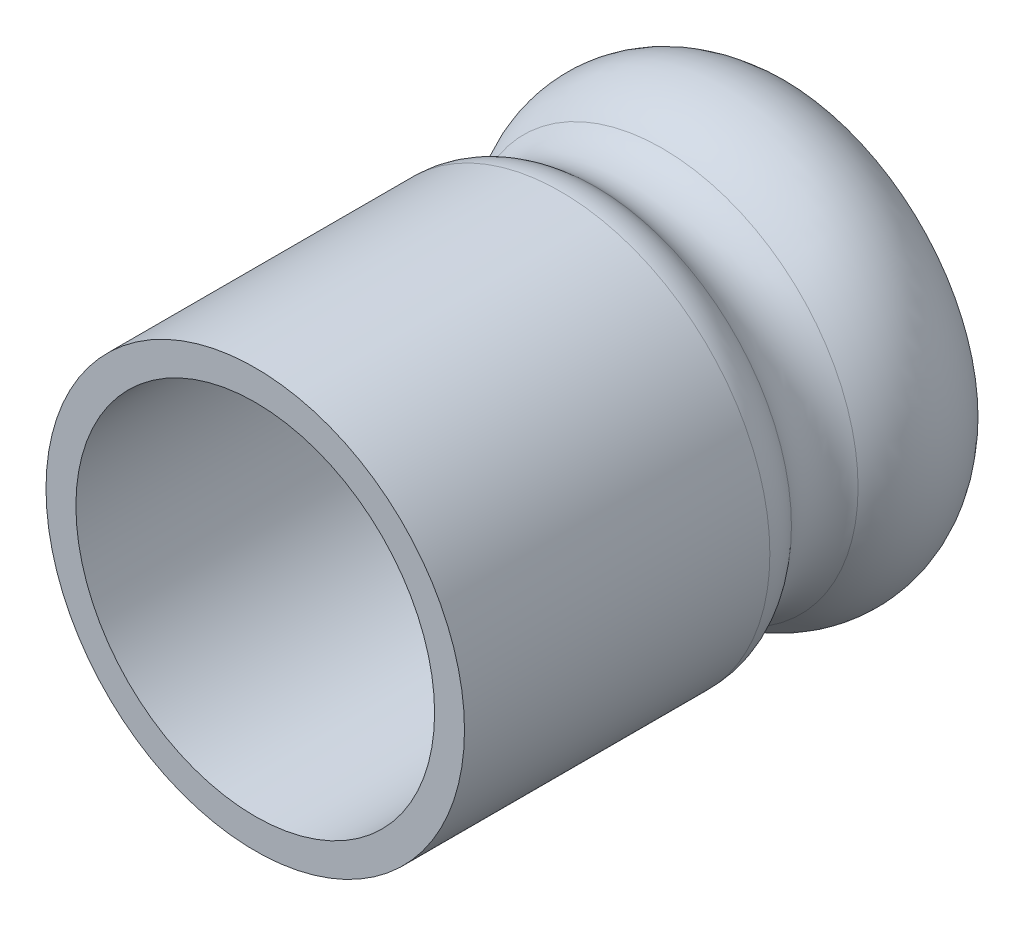
ISO-10303-21;
HEADER;
FILE_DESCRIPTION(('STEP AP214'),'2;1');
FILE_NAME('part.step','',(''),(''),'','','');
FILE_SCHEMA(('AUTOMOTIVE_DESIGN { 1 0 10303 214 1 1 1 1 }'));
ENDSEC;
DATA;
#1=APPLICATION_CONTEXT('core data for automotive mechanical design processes');
#2=APPLICATION_PROTOCOL_DEFINITION('international standard','automotive_design',2000,#1);
#3=PRODUCT_CONTEXT('',#1,'mechanical');
#4=PRODUCT('Part','Part','',(#3));
#5=PRODUCT_RELATED_PRODUCT_CATEGORY('part','',(#4));
#6=PRODUCT_DEFINITION_FORMATION('','',#4);
#7=PRODUCT_DEFINITION_CONTEXT('part definition',#1,'design');
#8=PRODUCT_DEFINITION('design','',#6,#7);
#9=PRODUCT_DEFINITION_SHAPE('','',#8);
#10=(LENGTH_UNIT() NAMED_UNIT(*) SI_UNIT(.MILLI.,.METRE.));
#11=(NAMED_UNIT(*) PLANE_ANGLE_UNIT() SI_UNIT($,.RADIAN.));
#12=(NAMED_UNIT(*) SI_UNIT($,.STERADIAN.) SOLID_ANGLE_UNIT());
#13=UNCERTAINTY_MEASURE_WITH_UNIT(LENGTH_MEASURE(1.E-05),#10,'distance_accuracy_value','');
#14=(GEOMETRIC_REPRESENTATION_CONTEXT(3) GLOBAL_UNCERTAINTY_ASSIGNED_CONTEXT((#13)) GLOBAL_UNIT_ASSIGNED_CONTEXT((#10,
#11,#12)) REPRESENTATION_CONTEXT('',''));
#15=CARTESIAN_POINT('',(0.,0.,0.));
#16=DIRECTION('',(0.,0.,1.));
#17=DIRECTION('',(1.,0.,0.));
#18=AXIS2_PLACEMENT_3D('',#15,#16,#17);
#19=CARTESIAN_POINT('',(0.,0.,-25.));
#20=DIRECTION('',(0.,0.,1.));
#21=DIRECTION('',(1.,0.,0.));
#22=AXIS2_PLACEMENT_3D('',#19,#20,#21);
#23=TOROIDAL_SURFACE('',#22,15.5868154157748,3.33681541577476);
#24=CARTESIAN_POINT('',(0.,0.,-27.2294699010187));
#25=DIRECTION('',(0.,0.,1.));
#26=DIRECTION('',(1.,0.,0.));
#27=AXIS2_PLACEMENT_3D('',#24,#25,#26);
#28=CIRCLE('',#27,13.1041150554003);
#29=CARTESIAN_POINT('',(13.1041150554003,0.,-27.2294699010187));
#30=VERTEX_POINT('',#29);
#31=EDGE_CURVE('E10',#30,#30,#28,.T.);
#32=ORIENTED_EDGE('',*,*,#31,.T.);
#33=EDGE_LOOP('',(#32));
#34=FACE_BOUND('',#33,.T.);
#35=CARTESIAN_POINT('',(0.,0.,-22.7705300989813));
#36=DIRECTION('',(0.,0.,1.));
#37=DIRECTION('',(1.,0.,0.));
#38=AXIS2_PLACEMENT_3D('',#35,#36,#37);
#39=CIRCLE('',#38,13.1041150554003);
#40=CARTESIAN_POINT('',(13.1041150554003,0.,-22.7705300989813));
#41=VERTEX_POINT('',#40);
#42=EDGE_CURVE('E67',#41,#41,#39,.T.);
#43=ORIENTED_EDGE('',*,*,#42,.F.);
#44=EDGE_LOOP('',(#43));
#45=FACE_BOUND('',#44,.T.);
#46=ADVANCED_FACE('F33',(#34,#45),#23,.F.);
#47=CARTESIAN_POINT('',(0.,0.,-31.2383279705642));
#48=DIRECTION('',(0.,0.,1.));
#49=DIRECTION('',(1.,0.,0.));
#50=AXIS2_PLACEMENT_3D('',#47,#48,#49);
#51=TOROIDAL_SURFACE('',#50,8.63991781757124,6.);
#52=CARTESIAN_POINT('',(0.,0.,-35.3193337313023));
#53=DIRECTION('',(0.,0.,1.));
#54=DIRECTION('',(1.,0.,0.));
#55=AXIS2_PLACEMENT_3D('',#52,#53,#54);
#56=CIRCLE('',#55,13.0382575021366);
#57=CARTESIAN_POINT('',(13.0382575021366,0.,-35.3193337313023));
#58=VERTEX_POINT('',#57);
#59=EDGE_CURVE('E39',#58,#58,#56,.T.);
#60=ORIENTED_EDGE('',*,*,#59,.T.);
#61=EDGE_LOOP('',(#60));
#62=FACE_BOUND('',#61,.T.);
#63=ORIENTED_EDGE('',*,*,#31,.F.);
#64=EDGE_LOOP('',(#63));
#65=FACE_BOUND('',#64,.T.);
#66=ADVANCED_FACE('F75',(#62,#65),#51,.T.);
#67=CARTESIAN_POINT('',(0.,0.,-35.));
#68=DIRECTION('',(0.,0.,-1.));
#69=DIRECTION('',(-1.,0.,0.));
#70=AXIS2_PLACEMENT_3D('',#67,#68,#69);
#71=CONICAL_SURFACE('',#70,10.,1.46607657167524);
#72=ORIENTED_EDGE('',*,*,#59,.F.);
#73=EDGE_LOOP('',(#72));
#74=FACE_BOUND('',#73,.T.);
#75=CARTESIAN_POINT('',(0.,0.,-35.));
#76=DIRECTION('',(0.,0.,1.));
#77=DIRECTION('',(1.,0.,0.));
#78=AXIS2_PLACEMENT_3D('',#75,#76,#77);
#79=CIRCLE('',#78,10.);
#80=CARTESIAN_POINT('',(10.,0.,-35.));
#81=VERTEX_POINT('',#80);
#82=EDGE_CURVE('E43',#81,#81,#79,.T.);
#83=ORIENTED_EDGE('',*,*,#82,.T.);
#84=EDGE_LOOP('',(#83));
#85=FACE_BOUND('',#84,.T.);
#86=ADVANCED_FACE('F79',(#74,#85),#71,.F.);
#87=CARTESIAN_POINT('',(0.,0.,-31.2383279705642));
#88=DIRECTION('',(0.,0.,1.));
#89=DIRECTION('',(1.,0.,0.));
#90=AXIS2_PLACEMENT_3D('',#87,#88,#89);
#91=TOROIDAL_SURFACE('',#90,8.63991781757124,4.);
#92=ORIENTED_EDGE('',*,*,#82,.F.);
#93=EDGE_LOOP('',(#92));
#94=FACE_BOUND('',#93,.T.);
#95=CARTESIAN_POINT('',(0.,0.,-28.5657559242005));
#96=DIRECTION('',(0.,0.,1.));
#97=DIRECTION('',(1.,0.,0.));
#98=AXIS2_PLACEMENT_3D('',#95,#96,#97);
#99=CIRCLE('',#98,11.6160493094573);
#100=CARTESIAN_POINT('',(11.6160493094573,0.,-28.5657559242005));
#101=VERTEX_POINT('',#100);
#102=EDGE_CURVE('E47',#101,#101,#99,.T.);
#103=ORIENTED_EDGE('',*,*,#102,.T.);
#104=EDGE_LOOP('',(#103));
#105=FACE_BOUND('',#104,.T.);
#106=ADVANCED_FACE('F83',(#94,#105),#91,.F.);
#107=CARTESIAN_POINT('',(0.,0.,-25.));
#108=DIRECTION('',(0.,0.,1.));
#109=DIRECTION('',(1.,0.,0.));
#110=AXIS2_PLACEMENT_3D('',#107,#108,#109);
#111=TOROIDAL_SURFACE('',#110,15.5868154157748,5.33681541577476);
#112=ORIENTED_EDGE('',*,*,#102,.F.);
#113=EDGE_LOOP('',(#112));
#114=FACE_BOUND('',#113,.T.);
#115=CARTESIAN_POINT('',(0.,0.,-21.4342440757995));
#116=DIRECTION('',(0.,0.,1.));
#117=DIRECTION('',(1.,0.,0.));
#118=AXIS2_PLACEMENT_3D('',#115,#116,#117);
#119=CIRCLE('',#118,11.6160493094573);
#120=CARTESIAN_POINT('',(11.6160493094573,0.,-21.4342440757995));
#121=VERTEX_POINT('',#120);
#122=EDGE_CURVE('E52',#121,#121,#119,.T.);
#123=ORIENTED_EDGE('',*,*,#122,.T.);
#124=EDGE_LOOP('',(#123));
#125=FACE_BOUND('',#124,.T.);
#126=ADVANCED_FACE('F90',(#114,#125),#111,.T.);
#127=CARTESIAN_POINT('',(0.,0.,-20.4320295584131));
#128=DIRECTION('',(0.,0.,1.));
#129=DIRECTION('',(1.,0.,0.));
#130=AXIS2_PLACEMENT_3D('',#127,#128,#129);
#131=TOROIDAL_SURFACE('',#130,10.5,1.5);
#132=ORIENTED_EDGE('',*,*,#122,.F.);
#133=EDGE_LOOP('',(#132));
#134=FACE_BOUND('',#133,.T.);
#135=CARTESIAN_POINT('',(0.,0.,-20.4320295584131));
#136=DIRECTION('',(0.,0.,1.));
#137=DIRECTION('',(1.,0.,0.));
#138=AXIS2_PLACEMENT_3D('',#135,#136,#137);
#139=CIRCLE('',#138,12.);
#140=CARTESIAN_POINT('',(12.,0.,-20.4320295584131));
#141=VERTEX_POINT('',#140);
#142=EDGE_CURVE('E55',#141,#141,#139,.T.);
#143=ORIENTED_EDGE('',*,*,#142,.T.);
#144=EDGE_LOOP('',(#143));
#145=FACE_BOUND('',#144,.T.);
#146=ADVANCED_FACE('F94',(#134,#145),#131,.F.);
#147=CARTESIAN_POINT('',(0.,0.,0.));
#148=DIRECTION('',(0.,0.,1.));
#149=DIRECTION('',(1.,0.,0.));
#150=AXIS2_PLACEMENT_3D('',#147,#148,#149);
#151=CYLINDRICAL_SURFACE('',#150,12.);
#152=ORIENTED_EDGE('',*,*,#142,.F.);
#153=EDGE_LOOP('',(#152));
#154=FACE_BOUND('',#153,.T.);
#155=CARTESIAN_POINT('',(0.,0.,0.));
#156=DIRECTION('',(0.,0.,1.));
#157=DIRECTION('',(1.,0.,0.));
#158=AXIS2_PLACEMENT_3D('',#155,#156,#157);
#159=CIRCLE('',#158,12.);
#160=CARTESIAN_POINT('',(12.,0.,0.));
#161=VERTEX_POINT('',#160);
#162=EDGE_CURVE('E58',#161,#161,#159,.T.);
#163=ORIENTED_EDGE('',*,*,#162,.T.);
#164=EDGE_LOOP('',(#163));
#165=FACE_BOUND('',#164,.T.);
#166=ADVANCED_FACE('F98',(#154,#165),#151,.F.);
#167=CARTESIAN_POINT('',(0.,0.,0.));
#168=DIRECTION('',(0.,0.,1.));
#169=DIRECTION('',(1.,0.,0.));
#170=AXIS2_PLACEMENT_3D('',#167,#168,#169);
#171=PLANE('',#170);
#172=CARTESIAN_POINT('',(0.,0.,0.));
#173=DIRECTION('',(0.,0.,1.));
#174=DIRECTION('',(1.,0.,0.));
#175=AXIS2_PLACEMENT_3D('',#172,#173,#174);
#176=CIRCLE('',#175,14.);
#177=CARTESIAN_POINT('',(14.,0.,0.));
#178=VERTEX_POINT('',#177);
#179=EDGE_CURVE('E61',#178,#178,#176,.T.);
#180=ORIENTED_EDGE('',*,*,#179,.T.);
#181=EDGE_LOOP('',(#180));
#182=FACE_BOUND('',#181,.T.);
#183=ORIENTED_EDGE('',*,*,#162,.F.);
#184=EDGE_LOOP('',(#183));
#185=FACE_BOUND('',#184,.T.);
#186=ADVANCED_FACE('F102',(#182,#185),#171,.T.);
#187=CARTESIAN_POINT('',(0.,0.,0.));
#188=DIRECTION('',(0.,0.,1.));
#189=DIRECTION('',(1.,0.,0.));
#190=AXIS2_PLACEMENT_3D('',#187,#188,#189);
#191=CYLINDRICAL_SURFACE('',#190,14.);
#192=CARTESIAN_POINT('',(0.,0.,-20.4320295584131));
#193=DIRECTION('',(0.,0.,1.));
#194=DIRECTION('',(1.,0.,0.));
#195=AXIS2_PLACEMENT_3D('',#192,#193,#194);
#196=CIRCLE('',#195,14.);
#197=CARTESIAN_POINT('',(14.,0.,-20.4320295584131));
#198=VERTEX_POINT('',#197);
#199=EDGE_CURVE('E64',#198,#198,#196,.T.);
#200=ORIENTED_EDGE('',*,*,#199,.T.);
#201=EDGE_LOOP('',(#200));
#202=FACE_BOUND('',#201,.T.);
#203=ORIENTED_EDGE('',*,*,#179,.F.);
#204=EDGE_LOOP('',(#203));
#205=FACE_BOUND('',#204,.T.);
#206=ADVANCED_FACE('F106',(#202,#205),#191,.T.);
#207=CARTESIAN_POINT('',(0.,0.,-20.4320295584131));
#208=DIRECTION('',(0.,0.,1.));
#209=DIRECTION('',(1.,0.,0.));
#210=AXIS2_PLACEMENT_3D('',#207,#208,#209);
#211=TOROIDAL_SURFACE('',#210,10.5,3.5);
#212=ORIENTED_EDGE('',*,*,#42,.T.);
#213=EDGE_LOOP('',(#212));
#214=FACE_BOUND('',#213,.T.);
#215=ORIENTED_EDGE('',*,*,#199,.F.);
#216=EDGE_LOOP('',(#215));
#217=FACE_BOUND('',#216,.T.);
#218=ADVANCED_FACE('F71',(#214,#217),#211,.T.);
#219=CLOSED_SHELL('',(#46,#66,#86,#106,#126,#146,#166,#186,#206,#218));
#220=MANIFOLD_SOLID_BREP('B2',#219);
#221=ADVANCED_BREP_SHAPE_REPRESENTATION('',(#18,#220),#14);
#222=SHAPE_DEFINITION_REPRESENTATION(#9,#221);
ENDSEC;
END-ISO-10303-21;
